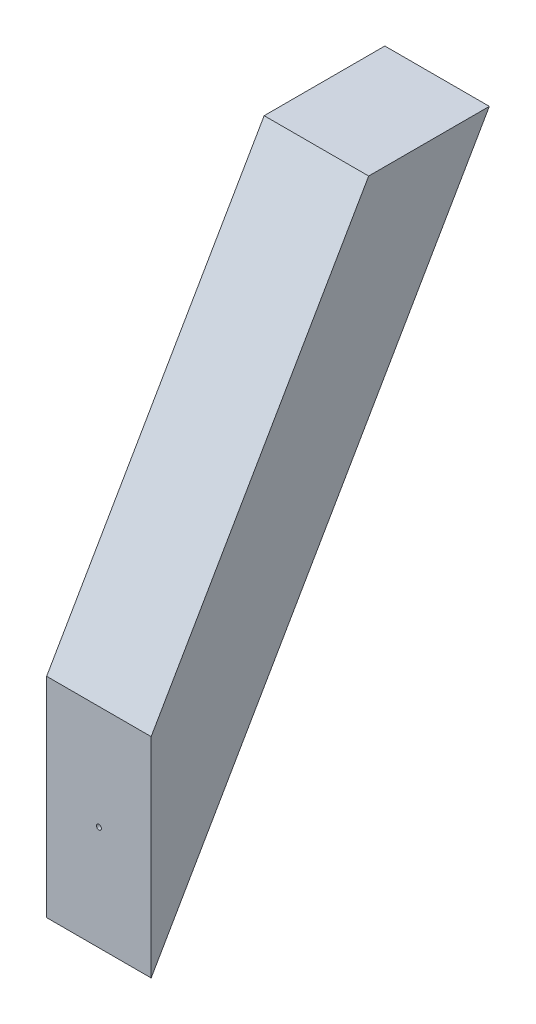
ISO-10303-21;
HEADER;
FILE_DESCRIPTION(('STEP AP214'),'2;1');
FILE_NAME('part.step','',(''),(''),'','','');
FILE_SCHEMA(('AUTOMOTIVE_DESIGN { 1 0 10303 214 1 1 1 1 }'));
ENDSEC;
DATA;
#1=APPLICATION_CONTEXT('core data for automotive mechanical design processes');
#2=APPLICATION_PROTOCOL_DEFINITION('international standard','automotive_design',2000,#1);
#3=PRODUCT_CONTEXT('',#1,'mechanical');
#4=PRODUCT('Part','Part','',(#3));
#5=PRODUCT_RELATED_PRODUCT_CATEGORY('part','',(#4));
#6=PRODUCT_DEFINITION_FORMATION('','',#4);
#7=PRODUCT_DEFINITION_CONTEXT('part definition',#1,'design');
#8=PRODUCT_DEFINITION('design','',#6,#7);
#9=PRODUCT_DEFINITION_SHAPE('','',#8);
#10=(LENGTH_UNIT() NAMED_UNIT(*) SI_UNIT(.MILLI.,.METRE.));
#11=(NAMED_UNIT(*) PLANE_ANGLE_UNIT() SI_UNIT($,.RADIAN.));
#12=(NAMED_UNIT(*) SI_UNIT($,.STERADIAN.) SOLID_ANGLE_UNIT());
#13=UNCERTAINTY_MEASURE_WITH_UNIT(LENGTH_MEASURE(1.E-05),#10,'distance_accuracy_value','');
#14=(GEOMETRIC_REPRESENTATION_CONTEXT(3) GLOBAL_UNCERTAINTY_ASSIGNED_CONTEXT((#13)) GLOBAL_UNIT_ASSIGNED_CONTEXT((#10,
#11,#12)) REPRESENTATION_CONTEXT('',''));
#15=CARTESIAN_POINT('',(0.,0.,0.));
#16=DIRECTION('',(0.,0.,1.));
#17=DIRECTION('',(1.,0.,0.));
#18=AXIS2_PLACEMENT_3D('',#15,#16,#17);
#19=CARTESIAN_POINT('',(12.7,142.357937738898,-82.1903936748331));
#20=DIRECTION('',(0.,0.500000000000001,0.866025403784438));
#21=DIRECTION('',(0.,-0.866025403784438,0.500000000000001));
#22=AXIS2_PLACEMENT_3D('',#19,#20,#21);
#23=PLANE('',#22);
#24=DIRECTION('',(0.,0.866025403784438,-0.500000000000001));
#25=VECTOR('',#24,1.);
#26=CARTESIAN_POINT('',(-12.7,142.357937738898,-82.1903936748331));
#27=LINE('',#26,#25);
#28=CARTESIAN_POINT('',(-12.7,0.,0.));
#29=VERTEX_POINT('',#28);
#30=CARTESIAN_POINT('',(-12.7,142.357937738898,-82.1903936748331));
#31=VERTEX_POINT('',#30);
#32=EDGE_CURVE('E102',#29,#31,#27,.T.);
#33=ORIENTED_EDGE('',*,*,#32,.T.);
#34=DIRECTION('',(-1.,0.,0.));
#35=VECTOR('',#34,1.);
#36=CARTESIAN_POINT('',(12.7,142.357937738898,-82.1903936748331));
#37=LINE('',#36,#35);
#38=CARTESIAN_POINT('',(12.7,142.357937738898,-82.1903936748331));
#39=VERTEX_POINT('',#38);
#40=EDGE_CURVE('E11',#39,#31,#37,.T.);
#41=ORIENTED_EDGE('',*,*,#40,.F.);
#42=DIRECTION('',(0.,0.866025403784438,-0.500000000000001));
#43=VECTOR('',#42,1.);
#44=CARTESIAN_POINT('',(12.7,142.357937738898,-82.1903936748331));
#45=LINE('',#44,#43);
#46=CARTESIAN_POINT('',(12.7,0.,0.));
#47=VERTEX_POINT('',#46);
#48=EDGE_CURVE('E113',#47,#39,#45,.T.);
#49=ORIENTED_EDGE('',*,*,#48,.F.);
#50=DIRECTION('',(-1.,0.,0.));
#51=VECTOR('',#50,1.);
#52=CARTESIAN_POINT('',(12.7,0.,0.));
#53=LINE('',#52,#51);
#54=EDGE_CURVE('E122',#47,#29,#53,.T.);
#55=ORIENTED_EDGE('',*,*,#54,.T.);
#56=EDGE_LOOP('',(#33,#41,#49,#55));
#57=FACE_BOUND('',#56,.T.);
#58=ADVANCED_FACE('F39',(#57),#23,.F.);
#59=CARTESIAN_POINT('',(12.7,142.357937738898,-52.8610000000001));
#60=DIRECTION('',(0.,-1.,0.));
#61=DIRECTION('',(0.,0.,-1.));
#62=AXIS2_PLACEMENT_3D('',#59,#60,#61);
#63=PLANE('',#62);
#64=DIRECTION('',(0.,0.,1.));
#65=VECTOR('',#64,1.);
#66=CARTESIAN_POINT('',(-12.7,142.357937738898,-52.8610000000001));
#67=LINE('',#66,#65);
#68=CARTESIAN_POINT('',(-12.7,142.357937738898,-52.8610000000001));
#69=VERTEX_POINT('',#68);
#70=EDGE_CURVE('E108',#31,#69,#67,.T.);
#71=ORIENTED_EDGE('',*,*,#70,.T.);
#72=DIRECTION('',(-1.,0.,0.));
#73=VECTOR('',#72,1.);
#74=CARTESIAN_POINT('',(12.7,142.357937738898,-52.8610000000001));
#75=LINE('',#74,#73);
#76=CARTESIAN_POINT('',(12.7,142.357937738898,-52.8610000000001));
#77=VERTEX_POINT('',#76);
#78=EDGE_CURVE('E48',#77,#69,#75,.T.);
#79=ORIENTED_EDGE('',*,*,#78,.F.);
#80=DIRECTION('',(0.,0.,1.));
#81=VECTOR('',#80,1.);
#82=CARTESIAN_POINT('',(12.7,142.357937738898,-52.8610000000001));
#83=LINE('',#82,#81);
#84=EDGE_CURVE('E87',#39,#77,#83,.T.);
#85=ORIENTED_EDGE('',*,*,#84,.F.);
#86=ORIENTED_EDGE('',*,*,#40,.T.);
#87=EDGE_LOOP('',(#71,#79,#85,#86));
#88=FACE_BOUND('',#87,.T.);
#89=ADVANCED_FACE('F152',(#88),#63,.F.);
#90=CARTESIAN_POINT('',(12.7,50.7999999999999,0.));
#91=DIRECTION('',(0.,-0.500000000000001,-0.866025403784438));
#92=DIRECTION('',(0.,0.866025403784438,-0.500000000000001));
#93=AXIS2_PLACEMENT_3D('',#90,#91,#92);
#94=PLANE('',#93);
#95=DIRECTION('',(0.,-0.866025403784438,0.500000000000001));
#96=VECTOR('',#95,1.);
#97=CARTESIAN_POINT('',(-12.7,50.7999999999999,0.));
#98=LINE('',#97,#96);
#99=CARTESIAN_POINT('',(-12.7,50.7999999999999,0.));
#100=VERTEX_POINT('',#99);
#101=EDGE_CURVE('E74',#69,#100,#98,.T.);
#102=ORIENTED_EDGE('',*,*,#101,.T.);
#103=DIRECTION('',(-1.,0.,0.));
#104=VECTOR('',#103,1.);
#105=CARTESIAN_POINT('',(12.7,50.7999999999999,0.));
#106=LINE('',#105,#104);
#107=CARTESIAN_POINT('',(12.7,50.7999999999999,0.));
#108=VERTEX_POINT('',#107);
#109=EDGE_CURVE('E132',#108,#100,#106,.T.);
#110=ORIENTED_EDGE('',*,*,#109,.F.);
#111=DIRECTION('',(0.,-0.866025403784438,0.500000000000001));
#112=VECTOR('',#111,1.);
#113=CARTESIAN_POINT('',(12.7,50.7999999999999,0.));
#114=LINE('',#113,#112);
#115=EDGE_CURVE('E118',#77,#108,#114,.T.);
#116=ORIENTED_EDGE('',*,*,#115,.F.);
#117=ORIENTED_EDGE('',*,*,#78,.T.);
#118=EDGE_LOOP('',(#102,#110,#116,#117));
#119=FACE_BOUND('',#118,.T.);
#120=ADVANCED_FACE('F136',(#119),#94,.F.);
#121=CARTESIAN_POINT('',(12.7,0.,0.));
#122=DIRECTION('',(0.,0.,-1.));
#123=DIRECTION('',(-1.,0.,0.));
#124=AXIS2_PLACEMENT_3D('',#121,#122,#123);
#125=PLANE('',#124);
#126=CARTESIAN_POINT('',(0.,25.3999999999999,0.));
#127=DIRECTION('',(0.,0.,1.));
#128=DIRECTION('',(1.,0.,0.));
#129=AXIS2_PLACEMENT_3D('',#126,#127,#128);
#130=CIRCLE('',#129,0.595629999999997);
#131=CARTESIAN_POINT('',(0.595629999999997,25.3999999999999,0.));
#132=VERTEX_POINT('',#131);
#133=EDGE_CURVE('E103',#132,#132,#130,.T.);
#134=ORIENTED_EDGE('',*,*,#133,.F.);
#135=EDGE_LOOP('',(#134));
#136=FACE_BOUND('',#135,.T.);
#137=DIRECTION('',(0.,-1.,0.));
#138=VECTOR('',#137,1.);
#139=CARTESIAN_POINT('',(-12.7,0.,0.));
#140=LINE('',#139,#138);
#141=EDGE_CURVE('E80',#100,#29,#140,.T.);
#142=ORIENTED_EDGE('',*,*,#141,.T.);
#143=ORIENTED_EDGE('',*,*,#54,.F.);
#144=DIRECTION('',(0.,-1.,0.));
#145=VECTOR('',#144,1.);
#146=CARTESIAN_POINT('',(12.7,0.,0.));
#147=LINE('',#146,#145);
#148=EDGE_CURVE('E56',#108,#47,#147,.T.);
#149=ORIENTED_EDGE('',*,*,#148,.F.);
#150=ORIENTED_EDGE('',*,*,#109,.T.);
#151=EDGE_LOOP('',(#142,#143,#149,#150));
#152=FACE_BOUND('',#151,.T.);
#153=ADVANCED_FACE('F142',(#136,#152),#125,.F.);
#154=CARTESIAN_POINT('',(12.7,0.,0.));
#155=DIRECTION('',(1.,0.,0.));
#156=DIRECTION('',(0.,0.,-1.));
#157=AXIS2_PLACEMENT_3D('',#154,#155,#156);
#158=PLANE('',#157);
#159=ORIENTED_EDGE('',*,*,#48,.T.);
#160=ORIENTED_EDGE('',*,*,#84,.T.);
#161=ORIENTED_EDGE('',*,*,#115,.T.);
#162=ORIENTED_EDGE('',*,*,#148,.T.);
#163=EDGE_LOOP('',(#159,#160,#161,#162));
#164=FACE_BOUND('',#163,.T.);
#165=ADVANCED_FACE('F144',(#164),#158,.T.);
#166=CARTESIAN_POINT('',(-12.7,0.,0.));
#167=DIRECTION('',(1.,0.,0.));
#168=DIRECTION('',(0.,0.,-1.));
#169=AXIS2_PLACEMENT_3D('',#166,#167,#168);
#170=PLANE('',#169);
#171=ORIENTED_EDGE('',*,*,#32,.F.);
#172=ORIENTED_EDGE('',*,*,#141,.F.);
#173=ORIENTED_EDGE('',*,*,#101,.F.);
#174=ORIENTED_EDGE('',*,*,#70,.F.);
#175=EDGE_LOOP('',(#171,#172,#173,#174));
#176=FACE_BOUND('',#175,.T.);
#177=ADVANCED_FACE('F95',(#176),#170,.F.);
#178=CARTESIAN_POINT('',(0.,25.3999999999999,-10.));
#179=DIRECTION('',(0.,0.,1.));
#180=DIRECTION('',(1.,0.,0.));
#181=AXIS2_PLACEMENT_3D('',#178,#179,#180);
#182=CONICAL_SURFACE('',#181,0.595629999999996,1.02974425867665);
#183=CARTESIAN_POINT('',(0.,25.3999999999999,-10.3578906105114));
#184=VERTEX_POINT('',#183);
#185=VERTEX_LOOP('',#184);
#186=FACE_BOUND('',#185,.T.);
#187=CARTESIAN_POINT('',(0.,25.3999999999999,-10.));
#188=DIRECTION('',(0.,0.,1.));
#189=DIRECTION('',(1.,0.,0.));
#190=AXIS2_PLACEMENT_3D('',#187,#188,#189);
#191=CIRCLE('',#190,0.595629999999996);
#192=CARTESIAN_POINT('',(0.595629999999996,25.3999999999999,-10.));
#193=VERTEX_POINT('',#192);
#194=EDGE_CURVE('E99',#193,#193,#191,.T.);
#195=ORIENTED_EDGE('',*,*,#194,.T.);
#196=EDGE_LOOP('',(#195));
#197=FACE_BOUND('',#196,.T.);
#198=ADVANCED_FACE('F91',(#186,#197),#182,.F.);
#199=CARTESIAN_POINT('',(0.,25.3999999999999,0.));
#200=DIRECTION('',(0.,0.,1.));
#201=DIRECTION('',(1.,0.,0.));
#202=AXIS2_PLACEMENT_3D('',#199,#200,#201);
#203=CYLINDRICAL_SURFACE('',#202,0.595629999999997);
#204=ORIENTED_EDGE('',*,*,#194,.F.);
#205=EDGE_LOOP('',(#204));
#206=FACE_BOUND('',#205,.T.);
#207=ORIENTED_EDGE('',*,*,#133,.T.);
#208=EDGE_LOOP('',(#207));
#209=FACE_BOUND('',#208,.T.);
#210=ADVANCED_FACE('F94',(#206,#209),#203,.F.);
#211=CLOSED_SHELL('',(#58,#89,#120,#153,#165,#177,#198,#210));
#212=MANIFOLD_SOLID_BREP('B2',#211);
#213=ADVANCED_BREP_SHAPE_REPRESENTATION('',(#18,#212),#14);
#214=SHAPE_DEFINITION_REPRESENTATION(#9,#213);
ENDSEC;
END-ISO-10303-21;
